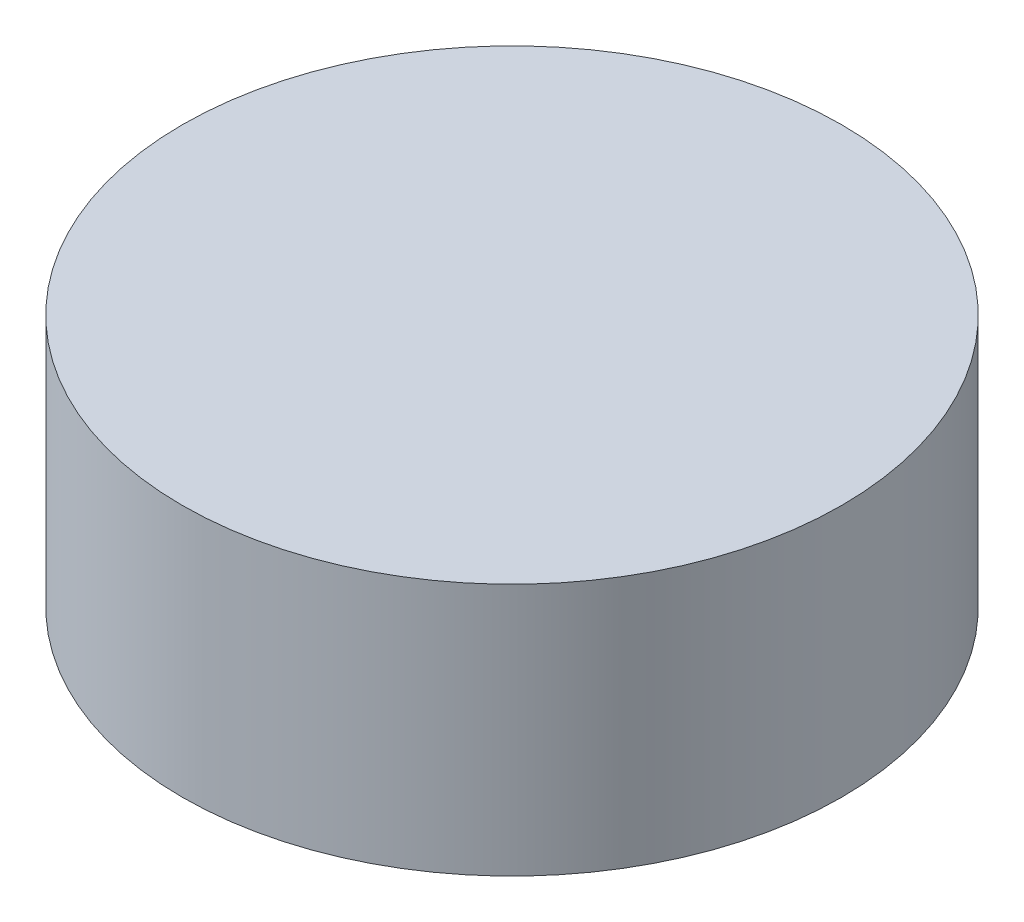
ISO-10303-21;
HEADER;
FILE_DESCRIPTION(('STEP AP214'),'2;1');
FILE_NAME('part.step','',(''),(''),'','','');
FILE_SCHEMA(('AUTOMOTIVE_DESIGN { 1 0 10303 214 1 1 1 1 }'));
ENDSEC;
DATA;
#1=APPLICATION_CONTEXT('core data for automotive mechanical design processes');
#2=APPLICATION_PROTOCOL_DEFINITION('international standard','automotive_design',2000,#1);
#3=PRODUCT_CONTEXT('',#1,'mechanical');
#4=PRODUCT('Part','Part','',(#3));
#5=PRODUCT_RELATED_PRODUCT_CATEGORY('part','',(#4));
#6=PRODUCT_DEFINITION_FORMATION('','',#4);
#7=PRODUCT_DEFINITION_CONTEXT('part definition',#1,'design');
#8=PRODUCT_DEFINITION('design','',#6,#7);
#9=PRODUCT_DEFINITION_SHAPE('','',#8);
#10=(LENGTH_UNIT() NAMED_UNIT(*) SI_UNIT(.MILLI.,.METRE.));
#11=(NAMED_UNIT(*) PLANE_ANGLE_UNIT() SI_UNIT($,.RADIAN.));
#12=(NAMED_UNIT(*) SI_UNIT($,.STERADIAN.) SOLID_ANGLE_UNIT());
#13=UNCERTAINTY_MEASURE_WITH_UNIT(LENGTH_MEASURE(1.E-05),#10,'distance_accuracy_value','');
#14=(GEOMETRIC_REPRESENTATION_CONTEXT(3) GLOBAL_UNCERTAINTY_ASSIGNED_CONTEXT((#13)) GLOBAL_UNIT_ASSIGNED_CONTEXT((#10,
#11,#12)) REPRESENTATION_CONTEXT('',''));
#15=CARTESIAN_POINT('',(0.,0.,0.));
#16=DIRECTION('',(0.,0.,1.));
#17=DIRECTION('',(1.,0.,0.));
#18=AXIS2_PLACEMENT_3D('',#15,#16,#17);
#19=CARTESIAN_POINT('',(0.,23.,0.));
#20=DIRECTION('',(0.,-1.,0.));
#21=DIRECTION('',(0.,0.,-1.));
#22=AXIS2_PLACEMENT_3D('',#19,#20,#21);
#23=CYLINDRICAL_SURFACE('',#22,30.);
#24=CARTESIAN_POINT('',(0.,23.,0.));
#25=DIRECTION('',(0.,1.,0.));
#26=DIRECTION('',(0.,0.,1.));
#27=AXIS2_PLACEMENT_3D('',#24,#25,#26);
#28=CIRCLE('',#27,30.);
#29=CARTESIAN_POINT('',(0.,23.,30.));
#30=VERTEX_POINT('',#29);
#31=EDGE_CURVE('E10',#30,#30,#28,.T.);
#32=ORIENTED_EDGE('',*,*,#31,.F.);
#33=EDGE_LOOP('',(#32));
#34=FACE_BOUND('',#33,.T.);
#35=CARTESIAN_POINT('',(0.,0.,0.));
#36=DIRECTION('',(0.,1.,0.));
#37=DIRECTION('',(0.,0.,1.));
#38=AXIS2_PLACEMENT_3D('',#35,#36,#37);
#39=CIRCLE('',#38,30.);
#40=CARTESIAN_POINT('',(0.,0.,30.));
#41=VERTEX_POINT('',#40);
#42=EDGE_CURVE('E36',#41,#41,#39,.T.);
#43=ORIENTED_EDGE('',*,*,#42,.T.);
#44=EDGE_LOOP('',(#43));
#45=FACE_BOUND('',#44,.T.);
#46=ADVANCED_FACE('F33',(#34,#45),#23,.T.);
#47=CARTESIAN_POINT('',(0.,23.,0.));
#48=DIRECTION('',(0.,1.,0.));
#49=DIRECTION('',(0.,0.,1.));
#50=AXIS2_PLACEMENT_3D('',#47,#48,#49);
#51=PLANE('',#50);
#52=ORIENTED_EDGE('',*,*,#31,.T.);
#53=EDGE_LOOP('',(#52));
#54=FACE_BOUND('',#53,.T.);
#55=ADVANCED_FACE('F48',(#54),#51,.T.);
#56=CARTESIAN_POINT('',(0.,0.,0.));
#57=DIRECTION('',(0.,1.,0.));
#58=DIRECTION('',(0.,0.,1.));
#59=AXIS2_PLACEMENT_3D('',#56,#57,#58);
#60=PLANE('',#59);
#61=ORIENTED_EDGE('',*,*,#42,.F.);
#62=EDGE_LOOP('',(#61));
#63=FACE_BOUND('',#62,.T.);
#64=ADVANCED_FACE('F46',(#63),#60,.F.);
#65=CLOSED_SHELL('',(#46,#55,#64));
#66=MANIFOLD_SOLID_BREP('B2',#65);
#67=ADVANCED_BREP_SHAPE_REPRESENTATION('',(#18,#66),#14);
#68=SHAPE_DEFINITION_REPRESENTATION(#9,#67);
ENDSEC;
END-ISO-10303-21;
